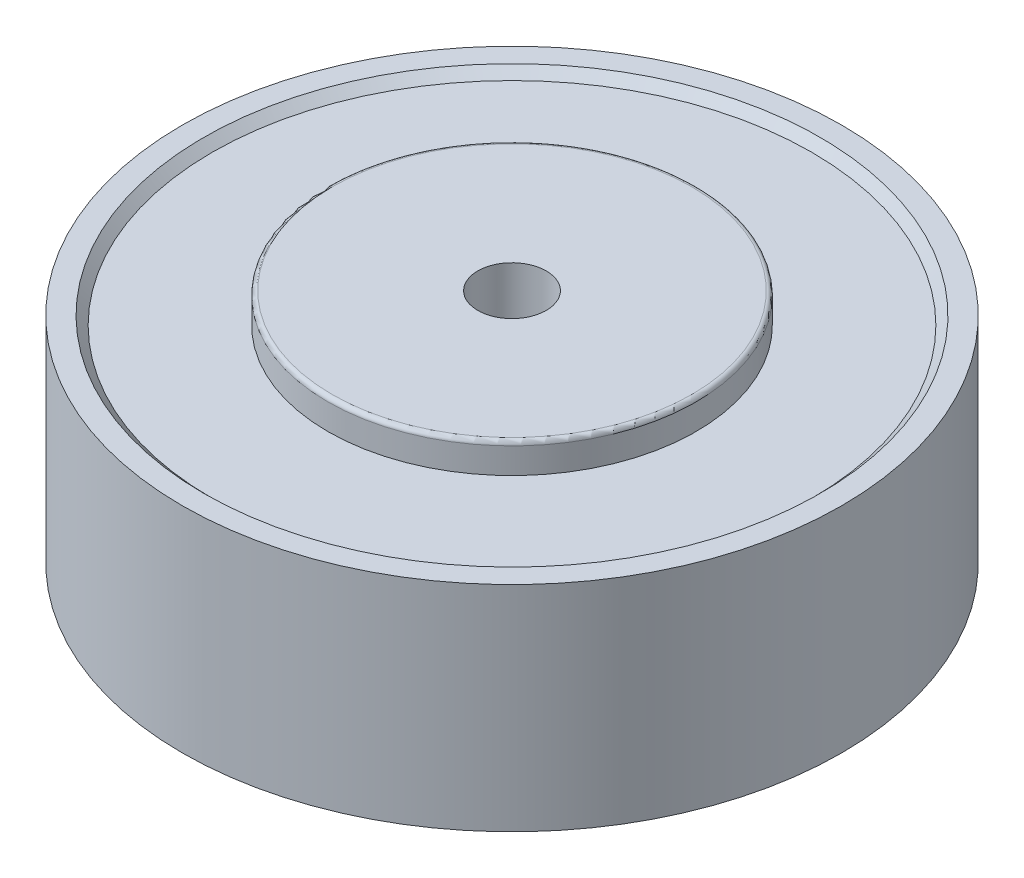
ISO-10303-21;
HEADER;
FILE_DESCRIPTION(('STEP AP214'),'2;1');
FILE_NAME('part.step','',(''),(''),'','','');
FILE_SCHEMA(('AUTOMOTIVE_DESIGN { 1 0 10303 214 1 1 1 1 }'));
ENDSEC;
DATA;
#1=APPLICATION_CONTEXT('core data for automotive mechanical design processes');
#2=APPLICATION_PROTOCOL_DEFINITION('international standard','automotive_design',2000,#1);
#3=PRODUCT_CONTEXT('',#1,'mechanical');
#4=PRODUCT('Part','Part','',(#3));
#5=PRODUCT_RELATED_PRODUCT_CATEGORY('part','',(#4));
#6=PRODUCT_DEFINITION_FORMATION('','',#4);
#7=PRODUCT_DEFINITION_CONTEXT('part definition',#1,'design');
#8=PRODUCT_DEFINITION('design','',#6,#7);
#9=PRODUCT_DEFINITION_SHAPE('','',#8);
#10=(LENGTH_UNIT() NAMED_UNIT(*) SI_UNIT(.MILLI.,.METRE.));
#11=(NAMED_UNIT(*) PLANE_ANGLE_UNIT() SI_UNIT($,.RADIAN.));
#12=(NAMED_UNIT(*) SI_UNIT($,.STERADIAN.) SOLID_ANGLE_UNIT());
#13=UNCERTAINTY_MEASURE_WITH_UNIT(LENGTH_MEASURE(1.E-05),#10,'distance_accuracy_value','');
#14=(GEOMETRIC_REPRESENTATION_CONTEXT(3) GLOBAL_UNCERTAINTY_ASSIGNED_CONTEXT((#13)) GLOBAL_UNIT_ASSIGNED_CONTEXT((#10,
#11,#12)) REPRESENTATION_CONTEXT('',''));
#15=CARTESIAN_POINT('',(0.,0.,0.));
#16=DIRECTION('',(0.,0.,1.));
#17=DIRECTION('',(1.,0.,0.));
#18=AXIS2_PLACEMENT_3D('',#15,#16,#17);
#19=CARTESIAN_POINT('',(0.,25.,0.));
#20=DIRECTION('',(0.,-1.,0.));
#21=DIRECTION('',(0.,0.,-1.));
#22=AXIS2_PLACEMENT_3D('',#19,#20,#21);
#23=CYLINDRICAL_SURFACE('',#22,38.5);
#24=CARTESIAN_POINT('',(0.,25.,0.));
#25=DIRECTION('',(0.,1.,0.));
#26=DIRECTION('',(0.,0.,1.));
#27=AXIS2_PLACEMENT_3D('',#24,#25,#26);
#28=CIRCLE('',#27,38.5);
#29=CARTESIAN_POINT('',(0.,25.,38.5));
#30=VERTEX_POINT('',#29);
#31=EDGE_CURVE('E59',#30,#30,#28,.T.);
#32=ORIENTED_EDGE('',*,*,#31,.F.);
#33=EDGE_LOOP('',(#32));
#34=FACE_BOUND('',#33,.T.);
#35=CARTESIAN_POINT('',(0.,0.,0.));
#36=DIRECTION('',(0.,1.,0.));
#37=DIRECTION('',(0.,0.,1.));
#38=AXIS2_PLACEMENT_3D('',#35,#36,#37);
#39=CIRCLE('',#38,38.5);
#40=CARTESIAN_POINT('',(0.,0.,38.5));
#41=VERTEX_POINT('',#40);
#42=EDGE_CURVE('E60',#41,#41,#39,.T.);
#43=ORIENTED_EDGE('',*,*,#42,.T.);
#44=EDGE_LOOP('',(#43));
#45=FACE_BOUND('',#44,.T.);
#46=ADVANCED_FACE('F33',(#34,#45),#23,.T.);
#47=CARTESIAN_POINT('',(0.,25.,0.));
#48=DIRECTION('',(0.,1.,0.));
#49=DIRECTION('',(0.,0.,1.));
#50=AXIS2_PLACEMENT_3D('',#47,#48,#49);
#51=PLANE('',#50);
#52=CARTESIAN_POINT('',(0.,25.,0.));
#53=DIRECTION('',(0.,1.,0.));
#54=DIRECTION('',(0.,0.,1.));
#55=AXIS2_PLACEMENT_3D('',#52,#53,#54);
#56=CIRCLE('',#55,36.);
#57=CARTESIAN_POINT('',(0.,25.,36.));
#58=VERTEX_POINT('',#57);
#59=EDGE_CURVE('E63',#58,#58,#56,.T.);
#60=ORIENTED_EDGE('',*,*,#59,.F.);
#61=EDGE_LOOP('',(#60));
#62=FACE_BOUND('',#61,.T.);
#63=ORIENTED_EDGE('',*,*,#31,.T.);
#64=EDGE_LOOP('',(#63));
#65=FACE_BOUND('',#64,.T.);
#66=ADVANCED_FACE('F107',(#62,#65),#51,.T.);
#67=CARTESIAN_POINT('',(0.,0.,0.));
#68=DIRECTION('',(0.,1.,0.));
#69=DIRECTION('',(0.,0.,1.));
#70=AXIS2_PLACEMENT_3D('',#67,#68,#69);
#71=PLANE('',#70);
#72=CARTESIAN_POINT('',(0.,0.,0.));
#73=DIRECTION('',(0.,-1.,0.));
#74=DIRECTION('',(0.,0.,-1.));
#75=AXIS2_PLACEMENT_3D('',#72,#73,#74);
#76=CIRCLE('',#75,36.);
#77=CARTESIAN_POINT('',(0.,0.,-36.));
#78=VERTEX_POINT('',#77);
#79=EDGE_CURVE('E68',#78,#78,#76,.T.);
#80=ORIENTED_EDGE('',*,*,#79,.F.);
#81=EDGE_LOOP('',(#80));
#82=FACE_BOUND('',#81,.T.);
#83=ORIENTED_EDGE('',*,*,#42,.F.);
#84=EDGE_LOOP('',(#83));
#85=FACE_BOUND('',#84,.T.);
#86=ADVANCED_FACE('F113',(#82,#85),#71,.F.);
#87=CARTESIAN_POINT('',(0.,24.,0.));
#88=DIRECTION('',(0.,1.,0.));
#89=DIRECTION('',(0.,0.,1.));
#90=AXIS2_PLACEMENT_3D('',#87,#88,#89);
#91=PLANE('',#90);
#92=CARTESIAN_POINT('',(0.,24.,0.));
#93=DIRECTION('',(0.,1.,0.));
#94=DIRECTION('',(0.,0.,1.));
#95=AXIS2_PLACEMENT_3D('',#92,#93,#94);
#96=CIRCLE('',#95,21.5);
#97=CARTESIAN_POINT('',(0.,24.,21.5));
#98=VERTEX_POINT('',#97);
#99=EDGE_CURVE('E74',#98,#98,#96,.T.);
#100=ORIENTED_EDGE('',*,*,#99,.F.);
#101=EDGE_LOOP('',(#100));
#102=FACE_BOUND('',#101,.T.);
#103=CARTESIAN_POINT('',(0.,24.,0.));
#104=DIRECTION('',(0.,1.,0.));
#105=DIRECTION('',(0.,0.,1.));
#106=AXIS2_PLACEMENT_3D('',#103,#104,#105);
#107=CIRCLE('',#106,35.);
#108=CARTESIAN_POINT('',(0.,24.,35.));
#109=VERTEX_POINT('',#108);
#110=EDGE_CURVE('E53',#109,#109,#107,.T.);
#111=ORIENTED_EDGE('',*,*,#110,.T.);
#112=EDGE_LOOP('',(#111));
#113=FACE_BOUND('',#112,.T.);
#114=ADVANCED_FACE('F142',(#102,#113),#91,.T.);
#115=CARTESIAN_POINT('',(0.,1.,0.));
#116=DIRECTION('',(0.,-1.,0.));
#117=DIRECTION('',(0.,0.,-1.));
#118=AXIS2_PLACEMENT_3D('',#115,#116,#117);
#119=PLANE('',#118);
#120=CARTESIAN_POINT('',(0.,1.,0.));
#121=DIRECTION('',(0.,-1.,0.));
#122=DIRECTION('',(0.,0.,-1.));
#123=AXIS2_PLACEMENT_3D('',#120,#121,#122);
#124=CIRCLE('',#123,21.5);
#125=CARTESIAN_POINT('',(0.,1.,-21.5));
#126=VERTEX_POINT('',#125);
#127=EDGE_CURVE('E71',#126,#126,#124,.T.);
#128=ORIENTED_EDGE('',*,*,#127,.F.);
#129=EDGE_LOOP('',(#128));
#130=FACE_BOUND('',#129,.T.);
#131=CARTESIAN_POINT('',(0.,1.,0.));
#132=DIRECTION('',(0.,-1.,0.));
#133=DIRECTION('',(0.,0.,-1.));
#134=AXIS2_PLACEMENT_3D('',#131,#132,#133);
#135=CIRCLE('',#134,35.);
#136=CARTESIAN_POINT('',(0.,1.,-35.));
#137=VERTEX_POINT('',#136);
#138=EDGE_CURVE('E56',#137,#137,#135,.T.);
#139=ORIENTED_EDGE('',*,*,#138,.T.);
#140=EDGE_LOOP('',(#139));
#141=FACE_BOUND('',#140,.T.);
#142=ADVANCED_FACE('F123',(#130,#141),#119,.T.);
#143=CARTESIAN_POINT('',(0.,1.,0.));
#144=DIRECTION('',(0.,-1.,0.));
#145=DIRECTION('',(0.,0.,-1.));
#146=AXIS2_PLACEMENT_3D('',#143,#144,#145);
#147=CONICAL_SURFACE('',#146,35.,0.785398163397459);
#148=ORIENTED_EDGE('',*,*,#79,.T.);
#149=EDGE_LOOP('',(#148));
#150=FACE_BOUND('',#149,.T.);
#151=ORIENTED_EDGE('',*,*,#138,.F.);
#152=EDGE_LOOP('',(#151));
#153=FACE_BOUND('',#152,.T.);
#154=ADVANCED_FACE('F120',(#150,#153),#147,.F.);
#155=CARTESIAN_POINT('',(0.,24.,0.));
#156=DIRECTION('',(0.,1.,0.));
#157=DIRECTION('',(0.,0.,1.));
#158=AXIS2_PLACEMENT_3D('',#155,#156,#157);
#159=CONICAL_SURFACE('',#158,35.,0.785398163397459);
#160=ORIENTED_EDGE('',*,*,#59,.T.);
#161=EDGE_LOOP('',(#160));
#162=FACE_BOUND('',#161,.T.);
#163=ORIENTED_EDGE('',*,*,#110,.F.);
#164=EDGE_LOOP('',(#163));
#165=FACE_BOUND('',#164,.T.);
#166=ADVANCED_FACE('F104',(#162,#165),#159,.F.);
#167=CARTESIAN_POINT('',(0.,-2.5,0.));
#168=DIRECTION('',(0.,1.,0.));
#169=DIRECTION('',(0.,0.,1.));
#170=AXIS2_PLACEMENT_3D('',#167,#168,#169);
#171=CYLINDRICAL_SURFACE('',#170,21.5);
#172=CARTESIAN_POINT('',(0.,-2.,0.));
#173=DIRECTION('',(0.,-1.,0.));
#174=DIRECTION('',(0.,0.,-1.));
#175=AXIS2_PLACEMENT_3D('',#172,#173,#174);
#176=CIRCLE('',#175,21.5);
#177=CARTESIAN_POINT('',(0.,-2.,-21.5));
#178=VERTEX_POINT('',#177);
#179=EDGE_CURVE('E10',#178,#178,#176,.F.);
#180=ORIENTED_EDGE('',*,*,#179,.T.);
#181=EDGE_LOOP('',(#180));
#182=FACE_BOUND('',#181,.T.);
#183=ORIENTED_EDGE('',*,*,#127,.T.);
#184=EDGE_LOOP('',(#183));
#185=FACE_BOUND('',#184,.T.);
#186=ADVANCED_FACE('F96',(#182,#185),#171,.T.);
#187=CARTESIAN_POINT('',(0.,-2.5,0.));
#188=DIRECTION('',(0.,-1.,0.));
#189=DIRECTION('',(0.,0.,-1.));
#190=AXIS2_PLACEMENT_3D('',#187,#188,#189);
#191=PLANE('',#190);
#192=CARTESIAN_POINT('',(0.,-2.5,0.));
#193=DIRECTION('',(0.,-1.,0.));
#194=DIRECTION('',(0.,0.,-1.));
#195=AXIS2_PLACEMENT_3D('',#192,#193,#194);
#196=CIRCLE('',#195,4.);
#197=CARTESIAN_POINT('',(0.,-2.5,-4.));
#198=VERTEX_POINT('',#197);
#199=EDGE_CURVE('E78',#198,#198,#196,.T.);
#200=ORIENTED_EDGE('',*,*,#199,.F.);
#201=EDGE_LOOP('',(#200));
#202=FACE_BOUND('',#201,.T.);
#203=CARTESIAN_POINT('',(0.,-2.5,0.));
#204=DIRECTION('',(0.,-1.,0.));
#205=DIRECTION('',(0.,0.,-1.));
#206=AXIS2_PLACEMENT_3D('',#203,#204,#205);
#207=CIRCLE('',#206,21.);
#208=CARTESIAN_POINT('',(0.,-2.5,-21.));
#209=VERTEX_POINT('',#208);
#210=EDGE_CURVE('E40',#209,#209,#207,.T.);
#211=ORIENTED_EDGE('',*,*,#210,.T.);
#212=EDGE_LOOP('',(#211));
#213=FACE_BOUND('',#212,.T.);
#214=ADVANCED_FACE('F93',(#202,#213),#191,.T.);
#215=CARTESIAN_POINT('',(0.,27.5,0.));
#216=DIRECTION('',(0.,-1.,0.));
#217=DIRECTION('',(0.,0.,-1.));
#218=AXIS2_PLACEMENT_3D('',#215,#216,#217);
#219=CYLINDRICAL_SURFACE('',#218,21.5);
#220=CARTESIAN_POINT('',(0.,27.,0.));
#221=DIRECTION('',(0.,1.,0.));
#222=DIRECTION('',(0.,0.,1.));
#223=AXIS2_PLACEMENT_3D('',#220,#221,#222);
#224=CIRCLE('',#223,21.5);
#225=CARTESIAN_POINT('',(0.,27.,21.5));
#226=VERTEX_POINT('',#225);
#227=EDGE_CURVE('E44',#226,#226,#224,.F.);
#228=ORIENTED_EDGE('',*,*,#227,.T.);
#229=EDGE_LOOP('',(#228));
#230=FACE_BOUND('',#229,.T.);
#231=ORIENTED_EDGE('',*,*,#99,.T.);
#232=EDGE_LOOP('',(#231));
#233=FACE_BOUND('',#232,.T.);
#234=ADVANCED_FACE('F95',(#230,#233),#219,.T.);
#235=CARTESIAN_POINT('',(0.,27.5,0.));
#236=DIRECTION('',(0.,1.,0.));
#237=DIRECTION('',(0.,0.,1.));
#238=AXIS2_PLACEMENT_3D('',#235,#236,#237);
#239=PLANE('',#238);
#240=CARTESIAN_POINT('',(0.,27.5,0.));
#241=DIRECTION('',(0.,-1.,0.));
#242=DIRECTION('',(0.,0.,-1.));
#243=AXIS2_PLACEMENT_3D('',#240,#241,#242);
#244=CIRCLE('',#243,4.);
#245=CARTESIAN_POINT('',(0.,27.5,-4.));
#246=VERTEX_POINT('',#245);
#247=EDGE_CURVE('E77',#246,#246,#244,.T.);
#248=ORIENTED_EDGE('',*,*,#247,.T.);
#249=EDGE_LOOP('',(#248));
#250=FACE_BOUND('',#249,.T.);
#251=CARTESIAN_POINT('',(0.,27.5,0.));
#252=DIRECTION('',(0.,1.,0.));
#253=DIRECTION('',(0.,0.,1.));
#254=AXIS2_PLACEMENT_3D('',#251,#252,#253);
#255=CIRCLE('',#254,21.);
#256=CARTESIAN_POINT('',(0.,27.5,21.));
#257=VERTEX_POINT('',#256);
#258=EDGE_CURVE('E48',#257,#257,#255,.T.);
#259=ORIENTED_EDGE('',*,*,#258,.T.);
#260=EDGE_LOOP('',(#259));
#261=FACE_BOUND('',#260,.T.);
#262=ADVANCED_FACE('F84',(#250,#261),#239,.T.);
#263=CARTESIAN_POINT('',(0.,27.,0.));
#264=DIRECTION('',(0.,1.,0.));
#265=DIRECTION('',(0.,0.,1.));
#266=AXIS2_PLACEMENT_3D('',#263,#264,#265);
#267=TOROIDAL_SURFACE('',#266,21.,0.5);
#268=ORIENTED_EDGE('',*,*,#227,.F.);
#269=EDGE_LOOP('',(#268));
#270=FACE_BOUND('',#269,.T.);
#271=ORIENTED_EDGE('',*,*,#258,.F.);
#272=EDGE_LOOP('',(#271));
#273=FACE_BOUND('',#272,.T.);
#274=ADVANCED_FACE('F127',(#270,#273),#267,.T.);
#275=CARTESIAN_POINT('',(0.,-2.,0.));
#276=DIRECTION('',(0.,-1.,0.));
#277=DIRECTION('',(0.,0.,-1.));
#278=AXIS2_PLACEMENT_3D('',#275,#276,#277);
#279=TOROIDAL_SURFACE('',#278,21.,0.5);
#280=ORIENTED_EDGE('',*,*,#179,.F.);
#281=EDGE_LOOP('',(#280));
#282=FACE_BOUND('',#281,.T.);
#283=ORIENTED_EDGE('',*,*,#210,.F.);
#284=EDGE_LOOP('',(#283));
#285=FACE_BOUND('',#284,.T.);
#286=ADVANCED_FACE('F35',(#282,#285),#279,.T.);
#287=CARTESIAN_POINT('',(0.,27.5,0.));
#288=DIRECTION('',(0.,-1.,0.));
#289=DIRECTION('',(0.,0.,-1.));
#290=AXIS2_PLACEMENT_3D('',#287,#288,#289);
#291=CYLINDRICAL_SURFACE('',#290,4.);
#292=ORIENTED_EDGE('',*,*,#247,.F.);
#293=EDGE_LOOP('',(#292));
#294=FACE_BOUND('',#293,.T.);
#295=ORIENTED_EDGE('',*,*,#199,.T.);
#296=EDGE_LOOP('',(#295));
#297=FACE_BOUND('',#296,.T.);
#298=ADVANCED_FACE('F87',(#294,#297),#291,.F.);
#299=CLOSED_SHELL('',(#46,#66,#86,#114,#142,#154,#166,#186,#214,#234,#262,#274,#286,#298));
#300=MANIFOLD_SOLID_BREP('B2',#299);
#301=ADVANCED_BREP_SHAPE_REPRESENTATION('',(#18,#300),#14);
#302=SHAPE_DEFINITION_REPRESENTATION(#9,#301);
ENDSEC;
END-ISO-10303-21;
